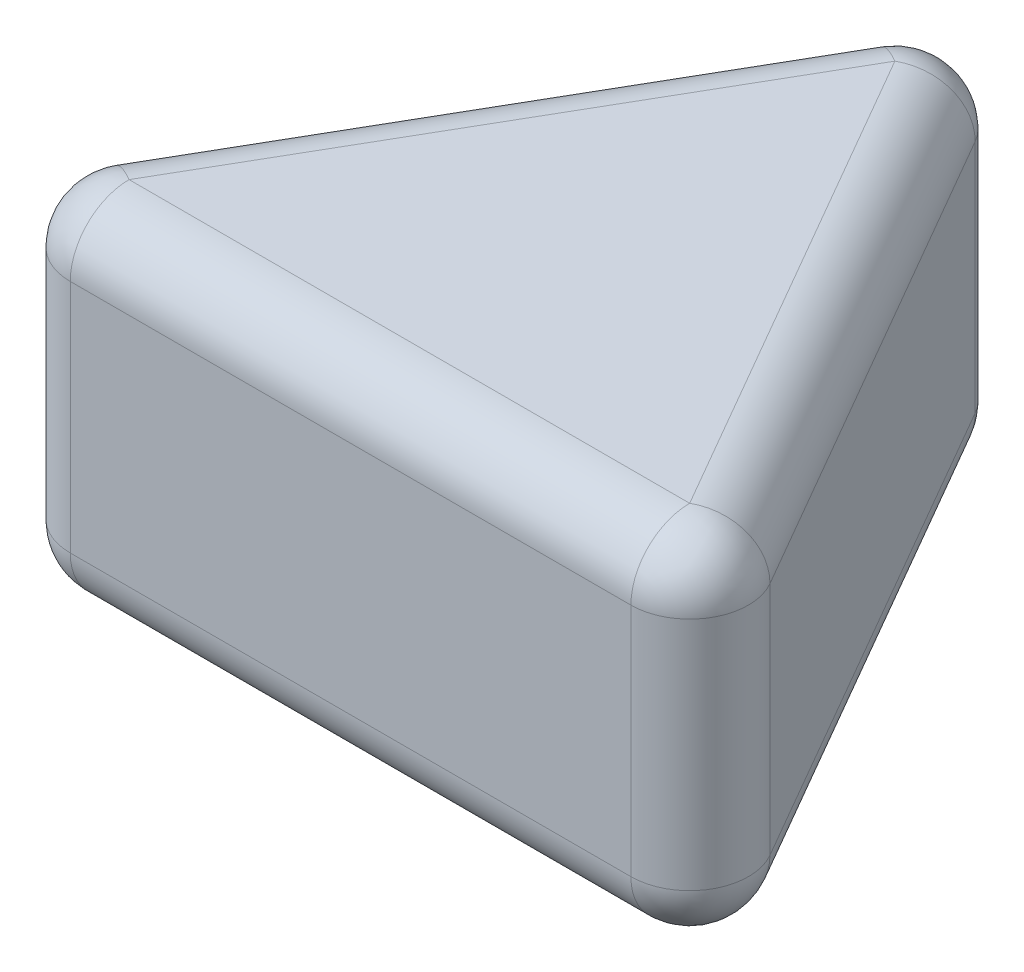
ISO-10303-21;
HEADER;
FILE_DESCRIPTION(('STEP AP214'),'2;1');
FILE_NAME('part.step','',(''),(''),'','','');
FILE_SCHEMA(('AUTOMOTIVE_DESIGN { 1 0 10303 214 1 1 1 1 }'));
ENDSEC;
DATA;
#1=APPLICATION_CONTEXT('core data for automotive mechanical design processes');
#2=APPLICATION_PROTOCOL_DEFINITION('international standard','automotive_design',2000,#1);
#3=PRODUCT_CONTEXT('',#1,'mechanical');
#4=PRODUCT('Part','Part','',(#3));
#5=PRODUCT_RELATED_PRODUCT_CATEGORY('part','',(#4));
#6=PRODUCT_DEFINITION_FORMATION('','',#4);
#7=PRODUCT_DEFINITION_CONTEXT('part definition',#1,'design');
#8=PRODUCT_DEFINITION('design','',#6,#7);
#9=PRODUCT_DEFINITION_SHAPE('','',#8);
#10=(LENGTH_UNIT() NAMED_UNIT(*) SI_UNIT(.MILLI.,.METRE.));
#11=(NAMED_UNIT(*) PLANE_ANGLE_UNIT() SI_UNIT($,.RADIAN.));
#12=(NAMED_UNIT(*) SI_UNIT($,.STERADIAN.) SOLID_ANGLE_UNIT());
#13=UNCERTAINTY_MEASURE_WITH_UNIT(LENGTH_MEASURE(1.E-05),#10,'distance_accuracy_value','');
#14=(GEOMETRIC_REPRESENTATION_CONTEXT(3) GLOBAL_UNCERTAINTY_ASSIGNED_CONTEXT((#13)) GLOBAL_UNIT_ASSIGNED_CONTEXT((#10,
#11,#12)) REPRESENTATION_CONTEXT('',''));
#15=CARTESIAN_POINT('',(0.,0.,0.));
#16=DIRECTION('',(0.,0.,1.));
#17=DIRECTION('',(1.,0.,0.));
#18=AXIS2_PLACEMENT_3D('',#15,#16,#17);
#19=CARTESIAN_POINT('',(13.,6.,0.));
#20=DIRECTION('',(0.,0.,-1.));
#21=DIRECTION('',(-1.,0.,0.));
#22=AXIS2_PLACEMENT_3D('',#19,#20,#21);
#23=PLANE('',#22);
#24=DIRECTION('',(0.,-1.,0.));
#25=VECTOR('',#24,1.);
#26=CARTESIAN_POINT('',(1.73205080756888,6.,0.));
#27=LINE('',#26,#25);
#28=CARTESIAN_POINT('',(1.73205080756888,5.,0.));
#29=VERTEX_POINT('',#28);
#30=CARTESIAN_POINT('',(1.73205080756888,1.,0.));
#31=VERTEX_POINT('',#30);
#32=EDGE_CURVE('E115',#29,#31,#27,.T.);
#33=ORIENTED_EDGE('',*,*,#32,.T.);
#34=DIRECTION('',(1.,0.,0.));
#35=VECTOR('',#34,1.);
#36=CARTESIAN_POINT('',(13.,1.,0.));
#37=LINE('',#36,#35);
#38=CARTESIAN_POINT('',(11.2679491924311,1.,0.));
#39=VERTEX_POINT('',#38);
#40=EDGE_CURVE('E111',#31,#39,#37,.T.);
#41=ORIENTED_EDGE('',*,*,#40,.T.);
#42=DIRECTION('',(0.,-1.,0.));
#43=VECTOR('',#42,1.);
#44=CARTESIAN_POINT('',(11.2679491924311,6.,0.));
#45=LINE('',#44,#43);
#46=CARTESIAN_POINT('',(11.2679491924311,5.,0.));
#47=VERTEX_POINT('',#46);
#48=EDGE_CURVE('E104',#39,#47,#45,.F.);
#49=ORIENTED_EDGE('',*,*,#48,.T.);
#50=DIRECTION('',(1.,0.,0.));
#51=VECTOR('',#50,1.);
#52=CARTESIAN_POINT('',(13.,5.,0.));
#53=LINE('',#52,#51);
#54=EDGE_CURVE('E108',#47,#29,#53,.F.);
#55=ORIENTED_EDGE('',*,*,#54,.T.);
#56=EDGE_LOOP('',(#33,#41,#49,#55));
#57=FACE_BOUND('',#56,.T.);
#58=ADVANCED_FACE('F35',(#57),#23,.F.);
#59=CARTESIAN_POINT('',(6.5,6.,-11.2583302491977));
#60=DIRECTION('',(-0.866025403784439,0.,0.5));
#61=DIRECTION('',(0.5,0.,0.866025403784439));
#62=AXIS2_PLACEMENT_3D('',#59,#60,#61);
#63=PLANE('',#62);
#64=DIRECTION('',(0.,-1.,0.));
#65=VECTOR('',#64,1.);
#66=CARTESIAN_POINT('',(12.1339745962156,6.,-1.5));
#67=LINE('',#66,#65);
#68=CARTESIAN_POINT('',(12.1339745962156,5.,-1.5));
#69=VERTEX_POINT('',#68);
#70=CARTESIAN_POINT('',(12.1339745962156,1.,-1.5));
#71=VERTEX_POINT('',#70);
#72=EDGE_CURVE('E123',#69,#71,#67,.T.);
#73=ORIENTED_EDGE('',*,*,#72,.T.);
#74=DIRECTION('',(-0.5,0.,-0.866025403784439));
#75=VECTOR('',#74,1.);
#76=CARTESIAN_POINT('',(6.5,1.,-11.2583302491977));
#77=LINE('',#76,#75);
#78=CARTESIAN_POINT('',(7.36602540378444,1.,-9.7583302491977));
#79=VERTEX_POINT('',#78);
#80=EDGE_CURVE('E160',#71,#79,#77,.T.);
#81=ORIENTED_EDGE('',*,*,#80,.T.);
#82=DIRECTION('',(0.,-1.,0.));
#83=VECTOR('',#82,1.);
#84=CARTESIAN_POINT('',(7.36602540378444,6.,-9.7583302491977));
#85=LINE('',#84,#83);
#86=CARTESIAN_POINT('',(7.36602540378444,5.,-9.7583302491977));
#87=VERTEX_POINT('',#86);
#88=EDGE_CURVE('E157',#79,#87,#85,.F.);
#89=ORIENTED_EDGE('',*,*,#88,.T.);
#90=DIRECTION('',(-0.5,0.,-0.866025403784439));
#91=VECTOR('',#90,1.);
#92=CARTESIAN_POINT('',(6.5,5.,-11.2583302491977));
#93=LINE('',#92,#91);
#94=EDGE_CURVE('E155',#87,#69,#93,.F.);
#95=ORIENTED_EDGE('',*,*,#94,.T.);
#96=EDGE_LOOP('',(#73,#81,#89,#95));
#97=FACE_BOUND('',#96,.T.);
#98=ADVANCED_FACE('F236',(#97),#63,.F.);
#99=CARTESIAN_POINT('',(0.,6.,0.));
#100=DIRECTION('',(0.866025403784439,0.,0.5));
#101=DIRECTION('',(0.5,0.,-0.866025403784439));
#102=AXIS2_PLACEMENT_3D('',#99,#100,#101);
#103=PLANE('',#102);
#104=DIRECTION('',(0.,-1.,0.));
#105=VECTOR('',#104,1.);
#106=CARTESIAN_POINT('',(5.63397459621556,6.,-9.7583302491977));
#107=LINE('',#106,#105);
#108=CARTESIAN_POINT('',(5.63397459621556,5.,-9.7583302491977));
#109=VERTEX_POINT('',#108);
#110=CARTESIAN_POINT('',(5.63397459621556,1.,-9.7583302491977));
#111=VERTEX_POINT('',#110);
#112=EDGE_CURVE('E148',#109,#111,#107,.T.);
#113=ORIENTED_EDGE('',*,*,#112,.T.);
#114=DIRECTION('',(-0.5,0.,0.866025403784439));
#115=VECTOR('',#114,1.);
#116=CARTESIAN_POINT('',(0.,1.,0.));
#117=LINE('',#116,#115);
#118=CARTESIAN_POINT('',(0.866025403784439,1.,-1.5));
#119=VERTEX_POINT('',#118);
#120=EDGE_CURVE('E153',#111,#119,#117,.T.);
#121=ORIENTED_EDGE('',*,*,#120,.T.);
#122=DIRECTION('',(0.,-1.,0.));
#123=VECTOR('',#122,1.);
#124=CARTESIAN_POINT('',(0.866025403784439,6.,-1.5));
#125=LINE('',#124,#123);
#126=CARTESIAN_POINT('',(0.866025403784439,5.,-1.5));
#127=VERTEX_POINT('',#126);
#128=EDGE_CURVE('E150',#119,#127,#125,.F.);
#129=ORIENTED_EDGE('',*,*,#128,.T.);
#130=DIRECTION('',(-0.5,0.,0.866025403784439));
#131=VECTOR('',#130,1.);
#132=CARTESIAN_POINT('',(0.,5.,0.));
#133=LINE('',#132,#131);
#134=EDGE_CURVE('E146',#127,#109,#133,.F.);
#135=ORIENTED_EDGE('',*,*,#134,.T.);
#136=EDGE_LOOP('',(#113,#121,#129,#135));
#137=FACE_BOUND('',#136,.T.);
#138=ADVANCED_FACE('F218',(#137),#103,.F.);
#139=CARTESIAN_POINT('',(0.,6.,0.));
#140=DIRECTION('',(0.,-1.,0.));
#141=DIRECTION('',(0.,0.,-1.));
#142=AXIS2_PLACEMENT_3D('',#139,#140,#141);
#143=PLANE('',#142);
#144=DIRECTION('',(-0.5,0.,-0.866025403784439));
#145=VECTOR('',#144,1.);
#146=CARTESIAN_POINT('',(8.88397459621556,6.,-5.12916512459885));
#147=LINE('',#146,#145);
#148=CARTESIAN_POINT('',(11.2679491924311,6.,-1.));
#149=VERTEX_POINT('',#148);
#150=CARTESIAN_POINT('',(6.5,6.,-9.2583302491977));
#151=VERTEX_POINT('',#150);
#152=EDGE_CURVE('E44',#149,#151,#147,.T.);
#153=ORIENTED_EDGE('',*,*,#152,.T.);
#154=DIRECTION('',(-0.5,0.,0.866025403784439));
#155=VECTOR('',#154,1.);
#156=CARTESIAN_POINT('',(0.866025403784439,6.,0.5));
#157=LINE('',#156,#155);
#158=CARTESIAN_POINT('',(1.73205080756888,6.,-1.));
#159=VERTEX_POINT('',#158);
#160=EDGE_CURVE('E11',#151,#159,#157,.T.);
#161=ORIENTED_EDGE('',*,*,#160,.T.);
#162=DIRECTION('',(1.,0.,0.));
#163=VECTOR('',#162,1.);
#164=CARTESIAN_POINT('',(0.,6.,-1.));
#165=LINE('',#164,#163);
#166=EDGE_CURVE('E54',#159,#149,#165,.T.);
#167=ORIENTED_EDGE('',*,*,#166,.T.);
#168=EDGE_LOOP('',(#153,#161,#167));
#169=FACE_BOUND('',#168,.T.);
#170=ADVANCED_FACE('F226',(#169),#143,.F.);
#171=CARTESIAN_POINT('',(0.,0.,0.));
#172=DIRECTION('',(0.,-1.,0.));
#173=DIRECTION('',(0.,0.,-1.));
#174=AXIS2_PLACEMENT_3D('',#171,#172,#173);
#175=PLANE('',#174);
#176=DIRECTION('',(-0.5,0.,0.866025403784439));
#177=VECTOR('',#176,1.);
#178=CARTESIAN_POINT('',(7.36602540378444,0.,-10.7583302491977));
#179=LINE('',#178,#177);
#180=CARTESIAN_POINT('',(1.73205080756888,0.,-1.));
#181=VERTEX_POINT('',#180);
#182=CARTESIAN_POINT('',(6.5,0.,-9.2583302491977));
#183=VERTEX_POINT('',#182);
#184=EDGE_CURVE('E164',#181,#183,#179,.F.);
#185=ORIENTED_EDGE('',*,*,#184,.T.);
#186=DIRECTION('',(-0.5,0.,-0.866025403784439));
#187=VECTOR('',#186,1.);
#188=CARTESIAN_POINT('',(12.1339745962156,0.,0.500000000000004));
#189=LINE('',#188,#187);
#190=CARTESIAN_POINT('',(11.2679491924311,0.,-1.));
#191=VERTEX_POINT('',#190);
#192=EDGE_CURVE('E166',#183,#191,#189,.F.);
#193=ORIENTED_EDGE('',*,*,#192,.T.);
#194=DIRECTION('',(1.,0.,0.));
#195=VECTOR('',#194,1.);
#196=CARTESIAN_POINT('',(0.,0.,-1.));
#197=LINE('',#196,#195);
#198=EDGE_CURVE('E162',#191,#181,#197,.F.);
#199=ORIENTED_EDGE('',*,*,#198,.T.);
#200=EDGE_LOOP('',(#185,#193,#199));
#201=FACE_BOUND('',#200,.T.);
#202=ADVANCED_FACE('F228',(#201),#175,.T.);
#203=CARTESIAN_POINT('',(8.88397459621556,5.,-5.12916512459885));
#204=DIRECTION('',(-0.5,0.,-0.866025403784439));
#205=DIRECTION('',(-0.866025403784439,0.,0.5));
#206=AXIS2_PLACEMENT_3D('',#203,#204,#205);
#207=CYLINDRICAL_SURFACE('',#206,1.);
#208=CARTESIAN_POINT('',(11.2679491924311,5.,-1.));
#209=DIRECTION('',(0.5,0.,0.866025403784439));
#210=DIRECTION('',(0.866025403784439,0.,-0.5));
#211=AXIS2_PLACEMENT_3D('',#208,#209,#210);
#212=CIRCLE('',#211,1.);
#213=EDGE_CURVE('E127',#69,#149,#212,.T.);
#214=ORIENTED_EDGE('',*,*,#213,.F.);
#215=ORIENTED_EDGE('',*,*,#94,.F.);
#216=CARTESIAN_POINT('',(6.5,5.,-9.2583302491977));
#217=DIRECTION('',(-0.500000000000001,0.,-0.866025403784438));
#218=DIRECTION('',(-0.866025403784438,0.,0.500000000000001));
#219=AXIS2_PLACEMENT_3D('',#216,#217,#218);
#220=CIRCLE('',#219,1.);
#221=EDGE_CURVE('E142',#151,#87,#220,.T.);
#222=ORIENTED_EDGE('',*,*,#221,.F.);
#223=ORIENTED_EDGE('',*,*,#152,.F.);
#224=EDGE_LOOP('',(#214,#215,#222,#223));
#225=FACE_BOUND('',#224,.T.);
#226=ADVANCED_FACE('F37',(#225),#207,.T.);
#227=CARTESIAN_POINT('',(11.2679491924311,6.,-1.));
#228=DIRECTION('',(0.,-1.,0.));
#229=DIRECTION('',(0.,0.,-1.));
#230=AXIS2_PLACEMENT_3D('',#227,#228,#229);
#231=CYLINDRICAL_SURFACE('',#230,1.);
#232=CARTESIAN_POINT('',(11.2679491924311,1.,-1.));
#233=DIRECTION('',(0.,-1.,0.));
#234=DIRECTION('',(0.,0.,-1.));
#235=AXIS2_PLACEMENT_3D('',#232,#233,#234);
#236=CIRCLE('',#235,1.);
#237=EDGE_CURVE('E128',#71,#39,#236,.T.);
#238=ORIENTED_EDGE('',*,*,#237,.F.);
#239=ORIENTED_EDGE('',*,*,#72,.F.);
#240=CARTESIAN_POINT('',(11.2679491924311,5.,-1.));
#241=DIRECTION('',(0.,1.,0.));
#242=DIRECTION('',(0.,0.,1.));
#243=AXIS2_PLACEMENT_3D('',#240,#241,#242);
#244=CIRCLE('',#243,1.);
#245=EDGE_CURVE('E119',#47,#69,#244,.T.);
#246=ORIENTED_EDGE('',*,*,#245,.F.);
#247=ORIENTED_EDGE('',*,*,#48,.F.);
#248=EDGE_LOOP('',(#238,#239,#246,#247));
#249=FACE_BOUND('',#248,.T.);
#250=ADVANCED_FACE('F121',(#249),#231,.T.);
#251=CARTESIAN_POINT('',(5.63397459621556,1.,-10.7583302491977));
#252=DIRECTION('',(0.5,0.,0.866025403784439));
#253=DIRECTION('',(0.866025403784439,0.,-0.5));
#254=AXIS2_PLACEMENT_3D('',#251,#252,#253);
#255=CYLINDRICAL_SURFACE('',#254,1.);
#256=CARTESIAN_POINT('',(6.5,1.,-9.2583302491977));
#257=DIRECTION('',(-0.5,0.,-0.866025403784438));
#258=DIRECTION('',(-0.866025403784438,0.,0.5));
#259=AXIS2_PLACEMENT_3D('',#256,#257,#258);
#260=CIRCLE('',#259,1.);
#261=EDGE_CURVE('E195',#79,#183,#260,.T.);
#262=ORIENTED_EDGE('',*,*,#261,.F.);
#263=ORIENTED_EDGE('',*,*,#80,.F.);
#264=CARTESIAN_POINT('',(11.2679491924311,1.,-1.));
#265=DIRECTION('',(0.500000000000001,0.,0.866025403784438));
#266=DIRECTION('',(0.866025403784438,0.,-0.500000000000001));
#267=AXIS2_PLACEMENT_3D('',#264,#265,#266);
#268=CIRCLE('',#267,1.);
#269=EDGE_CURVE('E198',#191,#71,#268,.T.);
#270=ORIENTED_EDGE('',*,*,#269,.F.);
#271=ORIENTED_EDGE('',*,*,#192,.F.);
#272=EDGE_LOOP('',(#262,#263,#270,#271));
#273=FACE_BOUND('',#272,.T.);
#274=ADVANCED_FACE('F283',(#273),#255,.T.);
#275=CARTESIAN_POINT('',(6.5,6.,-9.2583302491977));
#276=DIRECTION('',(0.,-1.,0.));
#277=DIRECTION('',(0.,0.,-1.));
#278=AXIS2_PLACEMENT_3D('',#275,#276,#277);
#279=CYLINDRICAL_SURFACE('',#278,1.);
#280=CARTESIAN_POINT('',(6.5,5.,-9.2583302491977));
#281=DIRECTION('',(0.,1.,0.));
#282=DIRECTION('',(0.,0.,1.));
#283=AXIS2_PLACEMENT_3D('',#280,#281,#282);
#284=CIRCLE('',#283,1.);
#285=EDGE_CURVE('E39',#87,#109,#284,.T.);
#286=ORIENTED_EDGE('',*,*,#285,.F.);
#287=ORIENTED_EDGE('',*,*,#88,.F.);
#288=CARTESIAN_POINT('',(6.5,1.,-9.2583302491977));
#289=DIRECTION('',(0.,-1.,0.));
#290=DIRECTION('',(0.,0.,-1.));
#291=AXIS2_PLACEMENT_3D('',#288,#289,#290);
#292=CIRCLE('',#291,1.);
#293=EDGE_CURVE('E192',#111,#79,#292,.T.);
#294=ORIENTED_EDGE('',*,*,#293,.F.);
#295=ORIENTED_EDGE('',*,*,#112,.F.);
#296=EDGE_LOOP('',(#286,#287,#294,#295));
#297=FACE_BOUND('',#296,.T.);
#298=ADVANCED_FACE('F213',(#297),#279,.T.);
#299=CARTESIAN_POINT('',(6.5,5.,-9.2583302491977));
#300=DIRECTION('',(0.,0.,1.));
#301=DIRECTION('',(1.,0.,0.));
#302=AXIS2_PLACEMENT_3D('',#299,#300,#301);
#303=SPHERICAL_SURFACE('',#302,1.);
#304=ORIENTED_EDGE('',*,*,#221,.T.);
#305=ORIENTED_EDGE('',*,*,#285,.T.);
#306=CARTESIAN_POINT('',(6.5,5.,-9.2583302491977));
#307=DIRECTION('',(0.5,0.,-0.866025403784438));
#308=DIRECTION('',(-0.866025403784438,0.,-0.5));
#309=AXIS2_PLACEMENT_3D('',#306,#307,#308);
#310=CIRCLE('',#309,1.);
#311=EDGE_CURVE('E134',#151,#109,#310,.F.);
#312=ORIENTED_EDGE('',*,*,#311,.F.);
#313=EDGE_LOOP('',(#304,#305,#312));
#314=FACE_BOUND('',#313,.T.);
#315=ADVANCED_FACE('F204',(#314),#303,.T.);
#316=CARTESIAN_POINT('',(11.2679491924311,5.,-1.));
#317=DIRECTION('',(0.,0.,1.));
#318=DIRECTION('',(1.,0.,0.));
#319=AXIS2_PLACEMENT_3D('',#316,#317,#318);
#320=SPHERICAL_SURFACE('',#319,1.);
#321=ORIENTED_EDGE('',*,*,#245,.T.);
#322=ORIENTED_EDGE('',*,*,#213,.T.);
#323=CARTESIAN_POINT('',(11.2679491924311,5.,-1.));
#324=DIRECTION('',(1.,0.,0.));
#325=DIRECTION('',(0.,0.,-1.));
#326=AXIS2_PLACEMENT_3D('',#323,#324,#325);
#327=CIRCLE('',#326,1.);
#328=EDGE_CURVE('E131',#47,#149,#327,.F.);
#329=ORIENTED_EDGE('',*,*,#328,.F.);
#330=EDGE_LOOP('',(#321,#322,#329));
#331=FACE_BOUND('',#330,.T.);
#332=ADVANCED_FACE('F132',(#331),#320,.T.);
#333=CARTESIAN_POINT('',(11.2679491924311,1.,-1.));
#334=DIRECTION('',(0.,0.,1.));
#335=DIRECTION('',(1.,0.,0.));
#336=AXIS2_PLACEMENT_3D('',#333,#334,#335);
#337=SPHERICAL_SURFACE('',#336,1.);
#338=ORIENTED_EDGE('',*,*,#269,.T.);
#339=ORIENTED_EDGE('',*,*,#237,.T.);
#340=CARTESIAN_POINT('',(11.2679491924311,1.,-1.));
#341=DIRECTION('',(1.,0.,0.));
#342=DIRECTION('',(0.,0.,-1.));
#343=AXIS2_PLACEMENT_3D('',#340,#341,#342);
#344=CIRCLE('',#343,1.);
#345=EDGE_CURVE('E135',#191,#39,#344,.F.);
#346=ORIENTED_EDGE('',*,*,#345,.F.);
#347=EDGE_LOOP('',(#338,#339,#346));
#348=FACE_BOUND('',#347,.T.);
#349=ADVANCED_FACE('F272',(#348),#337,.T.);
#350=CARTESIAN_POINT('',(6.5,1.,-9.2583302491977));
#351=DIRECTION('',(0.,0.,1.));
#352=DIRECTION('',(1.,0.,0.));
#353=AXIS2_PLACEMENT_3D('',#350,#351,#352);
#354=SPHERICAL_SURFACE('',#353,1.);
#355=ORIENTED_EDGE('',*,*,#293,.T.);
#356=ORIENTED_EDGE('',*,*,#261,.T.);
#357=CARTESIAN_POINT('',(6.5,1.,-9.2583302491977));
#358=DIRECTION('',(0.5,0.,-0.866025403784438));
#359=DIRECTION('',(-0.866025403784438,0.,-0.5));
#360=AXIS2_PLACEMENT_3D('',#357,#358,#359);
#361=CIRCLE('',#360,1.);
#362=EDGE_CURVE('E185',#111,#183,#361,.F.);
#363=ORIENTED_EDGE('',*,*,#362,.F.);
#364=EDGE_LOOP('',(#355,#356,#363));
#365=FACE_BOUND('',#364,.T.);
#366=ADVANCED_FACE('F269',(#365),#354,.T.);
#367=CARTESIAN_POINT('',(0.866025403784439,5.,0.5));
#368=DIRECTION('',(-0.5,0.,0.866025403784439));
#369=DIRECTION('',(0.866025403784439,0.,0.5));
#370=AXIS2_PLACEMENT_3D('',#367,#368,#369);
#371=CYLINDRICAL_SURFACE('',#370,1.);
#372=ORIENTED_EDGE('',*,*,#311,.T.);
#373=ORIENTED_EDGE('',*,*,#134,.F.);
#374=CARTESIAN_POINT('',(1.73205080756888,5.,-1.));
#375=DIRECTION('',(-0.500000000000001,0.,0.866025403784438));
#376=DIRECTION('',(0.866025403784438,0.,0.500000000000001));
#377=AXIS2_PLACEMENT_3D('',#374,#375,#376);
#378=CIRCLE('',#377,1.);
#379=EDGE_CURVE('E182',#159,#127,#378,.T.);
#380=ORIENTED_EDGE('',*,*,#379,.F.);
#381=ORIENTED_EDGE('',*,*,#160,.F.);
#382=EDGE_LOOP('',(#372,#373,#380,#381));
#383=FACE_BOUND('',#382,.T.);
#384=ADVANCED_FACE('F225',(#383),#371,.T.);
#385=CARTESIAN_POINT('',(0.,5.,-1.));
#386=DIRECTION('',(1.,0.,0.));
#387=DIRECTION('',(0.,0.,-1.));
#388=AXIS2_PLACEMENT_3D('',#385,#386,#387);
#389=CYLINDRICAL_SURFACE('',#388,1.);
#390=ORIENTED_EDGE('',*,*,#328,.T.);
#391=ORIENTED_EDGE('',*,*,#166,.F.);
#392=CARTESIAN_POINT('',(1.73205080756888,5.,-1.));
#393=DIRECTION('',(-1.,0.,0.));
#394=DIRECTION('',(0.,-1.,0.));
#395=AXIS2_PLACEMENT_3D('',#392,#393,#394);
#396=CIRCLE('',#395,1.);
#397=EDGE_CURVE('E138',#29,#159,#396,.T.);
#398=ORIENTED_EDGE('',*,*,#397,.F.);
#399=ORIENTED_EDGE('',*,*,#54,.F.);
#400=EDGE_LOOP('',(#390,#391,#398,#399));
#401=FACE_BOUND('',#400,.T.);
#402=ADVANCED_FACE('F137',(#401),#389,.T.);
#403=CARTESIAN_POINT('',(13.,1.,-1.));
#404=DIRECTION('',(-1.,0.,0.));
#405=DIRECTION('',(0.,0.,1.));
#406=AXIS2_PLACEMENT_3D('',#403,#404,#405);
#407=CYLINDRICAL_SURFACE('',#406,1.);
#408=ORIENTED_EDGE('',*,*,#345,.T.);
#409=ORIENTED_EDGE('',*,*,#40,.F.);
#410=CARTESIAN_POINT('',(1.73205080756888,1.,-1.));
#411=DIRECTION('',(-1.,0.,0.));
#412=DIRECTION('',(0.,0.,1.));
#413=AXIS2_PLACEMENT_3D('',#410,#411,#412);
#414=CIRCLE('',#413,1.);
#415=EDGE_CURVE('E178',#181,#31,#414,.T.);
#416=ORIENTED_EDGE('',*,*,#415,.F.);
#417=ORIENTED_EDGE('',*,*,#198,.F.);
#418=EDGE_LOOP('',(#408,#409,#416,#417));
#419=FACE_BOUND('',#418,.T.);
#420=ADVANCED_FACE('F260',(#419),#407,.T.);
#421=CARTESIAN_POINT('',(0.866025403784439,1.,0.5));
#422=DIRECTION('',(0.5,0.,-0.866025403784439));
#423=DIRECTION('',(-0.866025403784439,0.,-0.5));
#424=AXIS2_PLACEMENT_3D('',#421,#422,#423);
#425=CYLINDRICAL_SURFACE('',#424,1.);
#426=ORIENTED_EDGE('',*,*,#362,.T.);
#427=ORIENTED_EDGE('',*,*,#184,.F.);
#428=CARTESIAN_POINT('',(1.73205080756888,1.,-1.));
#429=DIRECTION('',(-0.5,0.,0.866025403784439));
#430=DIRECTION('',(0.866025403784439,0.,0.5));
#431=AXIS2_PLACEMENT_3D('',#428,#429,#430);
#432=CIRCLE('',#431,1.);
#433=EDGE_CURVE('E175',#119,#181,#432,.T.);
#434=ORIENTED_EDGE('',*,*,#433,.F.);
#435=ORIENTED_EDGE('',*,*,#120,.F.);
#436=EDGE_LOOP('',(#426,#427,#434,#435));
#437=FACE_BOUND('',#436,.T.);
#438=ADVANCED_FACE('F256',(#437),#425,.T.);
#439=CARTESIAN_POINT('',(1.73205080756888,5.,-1.));
#440=DIRECTION('',(0.,0.,1.));
#441=DIRECTION('',(1.,0.,0.));
#442=AXIS2_PLACEMENT_3D('',#439,#440,#441);
#443=SPHERICAL_SURFACE('',#442,1.);
#444=ORIENTED_EDGE('',*,*,#397,.T.);
#445=ORIENTED_EDGE('',*,*,#379,.T.);
#446=CARTESIAN_POINT('',(1.73205080756888,5.,-1.));
#447=DIRECTION('',(0.,1.,0.));
#448=DIRECTION('',(0.,0.,1.));
#449=AXIS2_PLACEMENT_3D('',#446,#447,#448);
#450=CIRCLE('',#449,1.);
#451=EDGE_CURVE('E173',#29,#127,#450,.F.);
#452=ORIENTED_EDGE('',*,*,#451,.F.);
#453=EDGE_LOOP('',(#444,#445,#452));
#454=FACE_BOUND('',#453,.T.);
#455=ADVANCED_FACE('F252',(#454),#443,.T.);
#456=CARTESIAN_POINT('',(1.73205080756888,1.,-1.));
#457=DIRECTION('',(0.,0.,1.));
#458=DIRECTION('',(1.,0.,0.));
#459=AXIS2_PLACEMENT_3D('',#456,#457,#458);
#460=SPHERICAL_SURFACE('',#459,1.);
#461=ORIENTED_EDGE('',*,*,#433,.T.);
#462=ORIENTED_EDGE('',*,*,#415,.T.);
#463=CARTESIAN_POINT('',(1.73205080756888,1.,-1.));
#464=DIRECTION('',(0.,-1.,0.));
#465=DIRECTION('',(0.,0.,-1.));
#466=AXIS2_PLACEMENT_3D('',#463,#464,#465);
#467=CIRCLE('',#466,1.);
#468=EDGE_CURVE('E171',#119,#31,#467,.F.);
#469=ORIENTED_EDGE('',*,*,#468,.F.);
#470=EDGE_LOOP('',(#461,#462,#469));
#471=FACE_BOUND('',#470,.T.);
#472=ADVANCED_FACE('F248',(#471),#460,.T.);
#473=CARTESIAN_POINT('',(1.73205080756888,6.,-1.));
#474=DIRECTION('',(0.,-1.,0.));
#475=DIRECTION('',(0.,0.,-1.));
#476=AXIS2_PLACEMENT_3D('',#473,#474,#475);
#477=CYLINDRICAL_SURFACE('',#476,1.);
#478=ORIENTED_EDGE('',*,*,#451,.T.);
#479=ORIENTED_EDGE('',*,*,#128,.F.);
#480=ORIENTED_EDGE('',*,*,#468,.T.);
#481=ORIENTED_EDGE('',*,*,#32,.F.);
#482=EDGE_LOOP('',(#478,#479,#480,#481));
#483=FACE_BOUND('',#482,.T.);
#484=ADVANCED_FACE('F245',(#483),#477,.T.);
#485=CLOSED_SHELL('',(#58,#98,#138,#170,#202,#226,#250,#274,#298,#315,#332,#349,#366,#384,#402,
#420,#438,#455,#472,#484));
#486=MANIFOLD_SOLID_BREP('B2',#485);
#487=ADVANCED_BREP_SHAPE_REPRESENTATION('',(#18,#486),#14);
#488=SHAPE_DEFINITION_REPRESENTATION(#9,#487);
ENDSEC;
END-ISO-10303-21;
